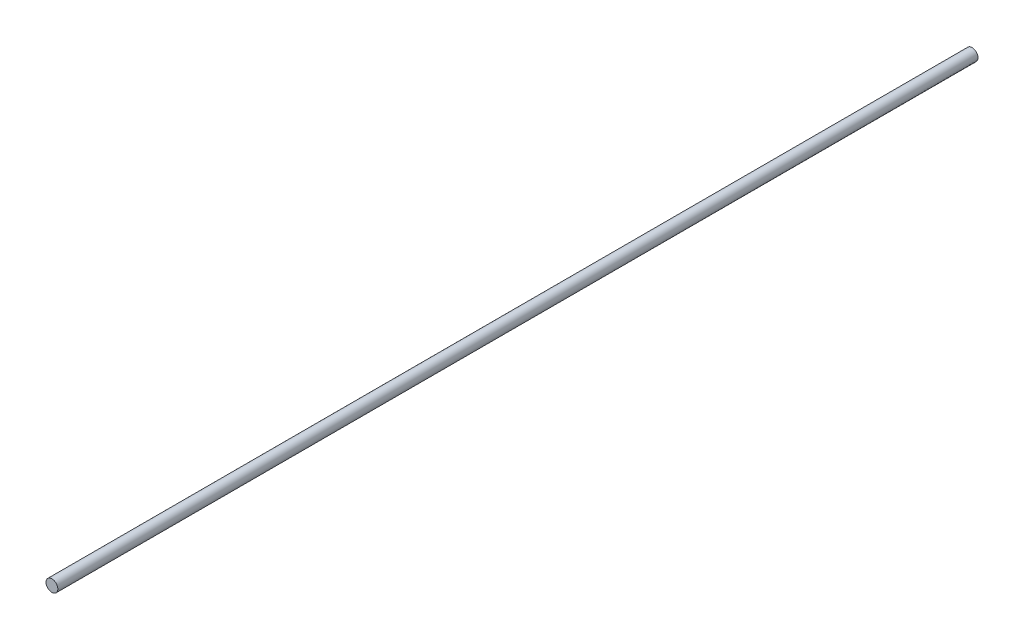
ISO-10303-21;
HEADER;
FILE_DESCRIPTION(('STEP AP214'),'2;1');
FILE_NAME('part.step','',(''),(''),'','','');
FILE_SCHEMA(('AUTOMOTIVE_DESIGN { 1 0 10303 214 1 1 1 1 }'));
ENDSEC;
DATA;
#1=APPLICATION_CONTEXT('core data for automotive mechanical design processes');
#2=APPLICATION_PROTOCOL_DEFINITION('international standard','automotive_design',2000,#1);
#3=PRODUCT_CONTEXT('',#1,'mechanical');
#4=PRODUCT('Part','Part','',(#3));
#5=PRODUCT_RELATED_PRODUCT_CATEGORY('part','',(#4));
#6=PRODUCT_DEFINITION_FORMATION('','',#4);
#7=PRODUCT_DEFINITION_CONTEXT('part definition',#1,'design');
#8=PRODUCT_DEFINITION('design','',#6,#7);
#9=PRODUCT_DEFINITION_SHAPE('','',#8);
#10=(LENGTH_UNIT() NAMED_UNIT(*) SI_UNIT(.MILLI.,.METRE.));
#11=(NAMED_UNIT(*) PLANE_ANGLE_UNIT() SI_UNIT($,.RADIAN.));
#12=(NAMED_UNIT(*) SI_UNIT($,.STERADIAN.) SOLID_ANGLE_UNIT());
#13=UNCERTAINTY_MEASURE_WITH_UNIT(LENGTH_MEASURE(1.E-05),#10,'distance_accuracy_value','');
#14=(GEOMETRIC_REPRESENTATION_CONTEXT(3) GLOBAL_UNCERTAINTY_ASSIGNED_CONTEXT((#13)) GLOBAL_UNIT_ASSIGNED_CONTEXT((#10,
#11,#12)) REPRESENTATION_CONTEXT('',''));
#15=CARTESIAN_POINT('',(0.,0.,0.));
#16=DIRECTION('',(0.,0.,1.));
#17=DIRECTION('',(1.,0.,0.));
#18=AXIS2_PLACEMENT_3D('',#15,#16,#17);
#19=CARTESIAN_POINT('',(0.,0.,70.));
#20=DIRECTION('',(0.,0.,-1.));
#21=DIRECTION('',(-1.,0.,0.));
#22=AXIS2_PLACEMENT_3D('',#19,#20,#21);
#23=CYLINDRICAL_SURFACE('',#22,0.45);
#24=CARTESIAN_POINT('',(0.,0.,70.));
#25=DIRECTION('',(0.,0.,1.));
#26=DIRECTION('',(1.,0.,0.));
#27=AXIS2_PLACEMENT_3D('',#24,#25,#26);
#28=CIRCLE('',#27,0.45);
#29=CARTESIAN_POINT('',(0.45,0.,70.));
#30=VERTEX_POINT('',#29);
#31=EDGE_CURVE('E10',#30,#30,#28,.T.);
#32=ORIENTED_EDGE('',*,*,#31,.F.);
#33=EDGE_LOOP('',(#32));
#34=FACE_BOUND('',#33,.T.);
#35=CARTESIAN_POINT('',(0.,0.,0.));
#36=DIRECTION('',(0.,0.,1.));
#37=DIRECTION('',(1.,0.,0.));
#38=AXIS2_PLACEMENT_3D('',#35,#36,#37);
#39=CIRCLE('',#38,0.45);
#40=CARTESIAN_POINT('',(0.45,0.,0.));
#41=VERTEX_POINT('',#40);
#42=EDGE_CURVE('E37',#41,#41,#39,.T.);
#43=ORIENTED_EDGE('',*,*,#42,.T.);
#44=EDGE_LOOP('',(#43));
#45=FACE_BOUND('',#44,.T.);
#46=ADVANCED_FACE('F34',(#34,#45),#23,.T.);
#47=CARTESIAN_POINT('',(0.,0.,70.));
#48=DIRECTION('',(0.,0.,1.));
#49=DIRECTION('',(1.,0.,0.));
#50=AXIS2_PLACEMENT_3D('',#47,#48,#49);
#51=PLANE('',#50);
#52=ORIENTED_EDGE('',*,*,#31,.T.);
#53=EDGE_LOOP('',(#52));
#54=FACE_BOUND('',#53,.T.);
#55=ADVANCED_FACE('F49',(#54),#51,.T.);
#56=CARTESIAN_POINT('',(0.,0.,0.));
#57=DIRECTION('',(0.,0.,1.));
#58=DIRECTION('',(1.,0.,0.));
#59=AXIS2_PLACEMENT_3D('',#56,#57,#58);
#60=PLANE('',#59);
#61=ORIENTED_EDGE('',*,*,#42,.F.);
#62=EDGE_LOOP('',(#61));
#63=FACE_BOUND('',#62,.T.);
#64=ADVANCED_FACE('F47',(#63),#60,.F.);
#65=CLOSED_SHELL('',(#46,#55,#64));
#66=MANIFOLD_SOLID_BREP('B2',#65);
#67=ADVANCED_BREP_SHAPE_REPRESENTATION('',(#18,#66),#14);
#68=SHAPE_DEFINITION_REPRESENTATION(#9,#67);
ENDSEC;
END-ISO-10303-21;
